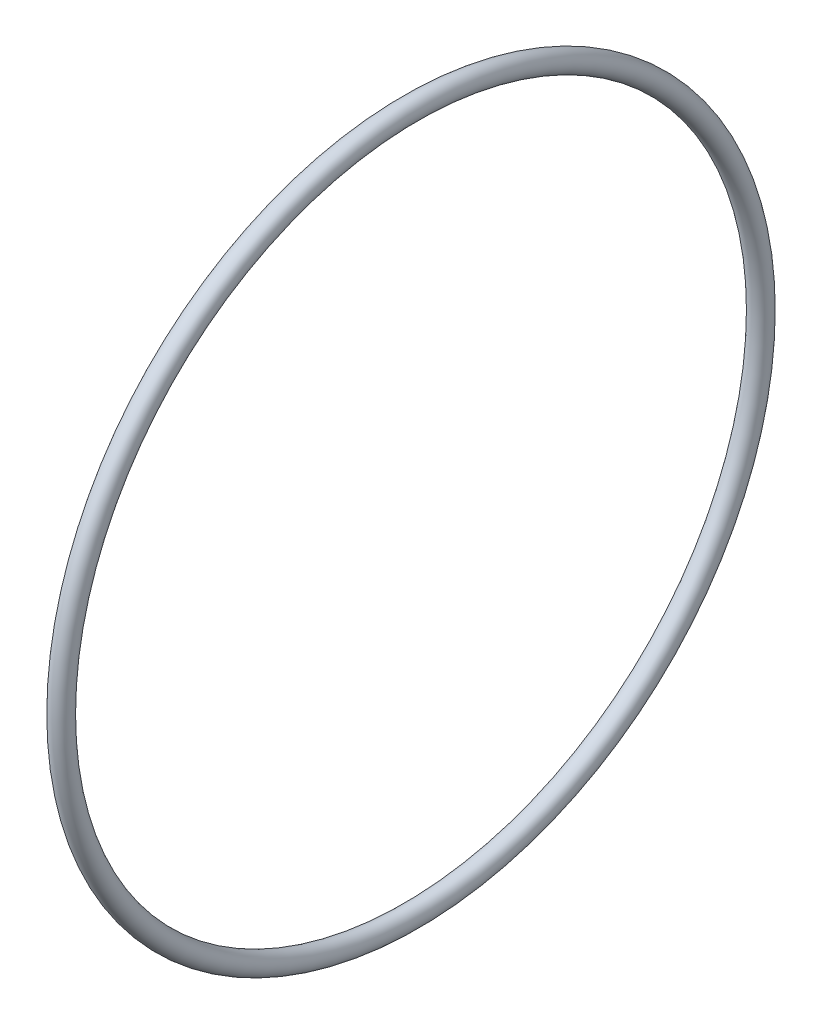
ISO-10303-21;
HEADER;
FILE_DESCRIPTION(('STEP AP214'),'2;1');
FILE_NAME('part.step','',(''),(''),'','','');
FILE_SCHEMA(('AUTOMOTIVE_DESIGN { 1 0 10303 214 1 1 1 1 }'));
ENDSEC;
DATA;
#1=APPLICATION_CONTEXT('core data for automotive mechanical design processes');
#2=APPLICATION_PROTOCOL_DEFINITION('international standard','automotive_design',2000,#1);
#3=PRODUCT_CONTEXT('',#1,'mechanical');
#4=PRODUCT('Part','Part','',(#3));
#5=PRODUCT_RELATED_PRODUCT_CATEGORY('part','',(#4));
#6=PRODUCT_DEFINITION_FORMATION('','',#4);
#7=PRODUCT_DEFINITION_CONTEXT('part definition',#1,'design');
#8=PRODUCT_DEFINITION('design','',#6,#7);
#9=PRODUCT_DEFINITION_SHAPE('','',#8);
#10=(LENGTH_UNIT() NAMED_UNIT(*) SI_UNIT(.MILLI.,.METRE.));
#11=(NAMED_UNIT(*) PLANE_ANGLE_UNIT() SI_UNIT($,.RADIAN.));
#12=(NAMED_UNIT(*) SI_UNIT($,.STERADIAN.) SOLID_ANGLE_UNIT());
#13=UNCERTAINTY_MEASURE_WITH_UNIT(LENGTH_MEASURE(1.E-05),#10,'distance_accuracy_value','');
#14=(GEOMETRIC_REPRESENTATION_CONTEXT(3) GLOBAL_UNCERTAINTY_ASSIGNED_CONTEXT((#13)) GLOBAL_UNIT_ASSIGNED_CONTEXT((#10,
#11,#12)) REPRESENTATION_CONTEXT('',''));
#15=CARTESIAN_POINT('',(0.,0.,0.));
#16=DIRECTION('',(0.,0.,1.));
#17=DIRECTION('',(1.,0.,0.));
#18=AXIS2_PLACEMENT_3D('',#15,#16,#17);
#19=CARTESIAN_POINT('',(-0.915199846000005,0.,0.));
#20=DIRECTION('',(-1.,0.,0.));
#21=DIRECTION('',(0.,0.,1.));
#22=AXIS2_PLACEMENT_3D('',#19,#20,#21);
#23=TOROIDAL_SURFACE('',#22,30.899999922,0.899999978000001);
#24=CARTESIAN_POINT('',(-0.915199846000005,0.,31.7999999));
#25=VERTEX_POINT('',#24);
#26=VERTEX_LOOP('',#25);
#27=FACE_BOUND('',#26,.T.);
#28=ADVANCED_FACE('F33',(#27),#23,.T.);
#29=CLOSED_SHELL('',(#28));
#30=MANIFOLD_SOLID_BREP('B2',#29);
#31=ADVANCED_BREP_SHAPE_REPRESENTATION('',(#18,#30),#14);
#32=SHAPE_DEFINITION_REPRESENTATION(#9,#31);
ENDSEC;
END-ISO-10303-21;
